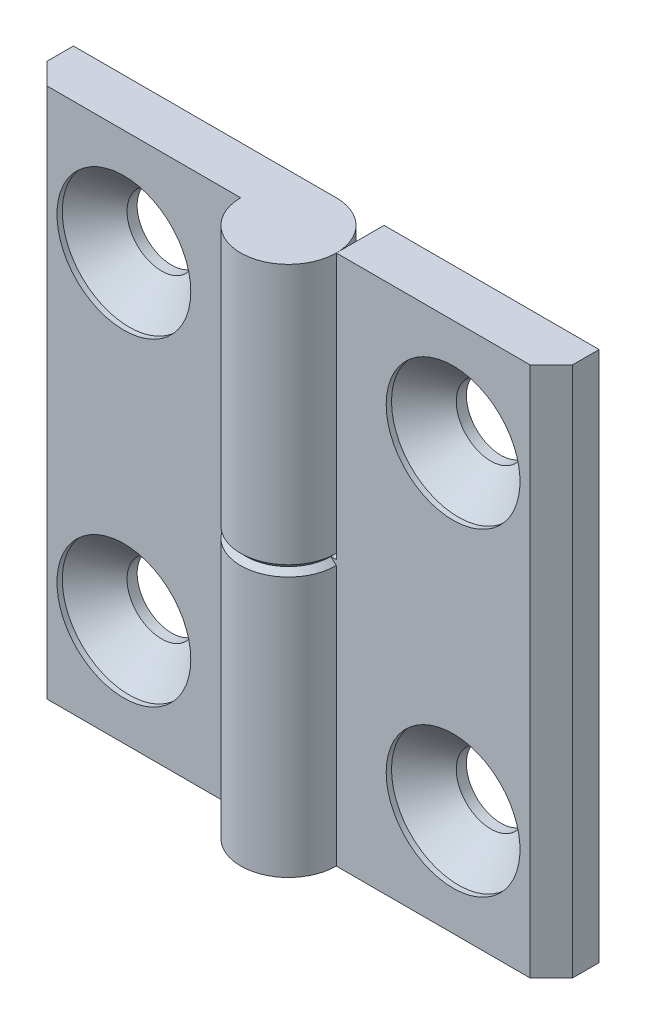
ISO-10303-21;
HEADER;
FILE_DESCRIPTION(('STEP AP214'),'2;1');
FILE_NAME('part.step','',(''),(''),'','','');
FILE_SCHEMA(('AUTOMOTIVE_DESIGN { 1 0 10303 214 1 1 1 1 }'));
ENDSEC;
DATA;
#1=APPLICATION_CONTEXT('core data for automotive mechanical design processes');
#2=APPLICATION_PROTOCOL_DEFINITION('international standard','automotive_design',2000,#1);
#3=PRODUCT_CONTEXT('',#1,'mechanical');
#4=PRODUCT('Part','Part','',(#3));
#5=PRODUCT_RELATED_PRODUCT_CATEGORY('part','',(#4));
#6=PRODUCT_DEFINITION_FORMATION('','',#4);
#7=PRODUCT_DEFINITION_CONTEXT('part definition',#1,'design');
#8=PRODUCT_DEFINITION('design','',#6,#7);
#9=PRODUCT_DEFINITION_SHAPE('','',#8);
#10=(LENGTH_UNIT() NAMED_UNIT(*) SI_UNIT(.MILLI.,.METRE.));
#11=(NAMED_UNIT(*) PLANE_ANGLE_UNIT() SI_UNIT($,.RADIAN.));
#12=(NAMED_UNIT(*) SI_UNIT($,.STERADIAN.) SOLID_ANGLE_UNIT());
#13=UNCERTAINTY_MEASURE_WITH_UNIT(LENGTH_MEASURE(1.E-05),#10,'distance_accuracy_value','');
#14=(GEOMETRIC_REPRESENTATION_CONTEXT(3) GLOBAL_UNCERTAINTY_ASSIGNED_CONTEXT((#13)) GLOBAL_UNIT_ASSIGNED_CONTEXT((#10,
#11,#12)) REPRESENTATION_CONTEXT('',''));
#15=CARTESIAN_POINT('',(0.,0.,0.));
#16=DIRECTION('',(0.,0.,1.));
#17=DIRECTION('',(1.,0.,0.));
#18=AXIS2_PLACEMENT_3D('',#15,#16,#17);
#19=CARTESIAN_POINT('',(0.,-25.,0.));
#20=DIRECTION('',(0.,1.,0.));
#21=DIRECTION('',(0.,0.,-1.));
#22=AXIS2_PLACEMENT_3D('',#19,#20,#21);
#23=CYLINDRICAL_SURFACE('',#22,4.5);
#24=DIRECTION('',(0.,1.,0.));
#25=VECTOR('',#24,1.);
#26=CARTESIAN_POINT('',(4.5,-25.,0.));
#27=LINE('',#26,#25);
#28=CARTESIAN_POINT('',(4.5,-25.,0.));
#29=VERTEX_POINT('',#28);
#30=CARTESIAN_POINT('',(4.5,-0.499999999999987,0.));
#31=VERTEX_POINT('',#30);
#32=EDGE_CURVE('E157',#29,#31,#27,.T.);
#33=ORIENTED_EDGE('',*,*,#32,.T.);
#34=CARTESIAN_POINT('',(0.,-0.499999999999987,0.));
#35=DIRECTION('',(0.,-1.,0.));
#36=DIRECTION('',(0.,0.,1.));
#37=AXIS2_PLACEMENT_3D('',#34,#35,#36);
#38=CIRCLE('',#37,4.5);
#39=CARTESIAN_POINT('',(0.,-0.499999999999987,-4.5));
#40=VERTEX_POINT('',#39);
#41=EDGE_CURVE('E175',#31,#40,#38,.T.);
#42=ORIENTED_EDGE('',*,*,#41,.T.);
#43=DIRECTION('',(0.,1.,0.));
#44=VECTOR('',#43,1.);
#45=CARTESIAN_POINT('',(0.,-25.,-4.5));
#46=LINE('',#45,#44);
#47=CARTESIAN_POINT('',(0.,-25.,-4.5));
#48=VERTEX_POINT('',#47);
#49=EDGE_CURVE('E167',#48,#40,#46,.T.);
#50=ORIENTED_EDGE('',*,*,#49,.F.);
#51=CARTESIAN_POINT('',(0.,-25.,0.));
#52=DIRECTION('',(0.,-1.,0.));
#53=DIRECTION('',(0.,0.,1.));
#54=AXIS2_PLACEMENT_3D('',#51,#52,#53);
#55=CIRCLE('',#54,4.5);
#56=EDGE_CURVE('E156',#29,#48,#55,.T.);
#57=ORIENTED_EDGE('',*,*,#56,.F.);
#58=EDGE_LOOP('',(#33,#42,#50,#57));
#59=FACE_BOUND('',#58,.T.);
#60=ADVANCED_FACE('F46',(#59),#23,.T.);
#61=CARTESIAN_POINT('',(0.,-25.,-4.5));
#62=DIRECTION('',(0.,0.,1.));
#63=DIRECTION('',(-1.,0.,0.));
#64=AXIS2_PLACEMENT_3D('',#61,#62,#63);
#65=PLANE('',#64);
#66=CARTESIAN_POINT('',(15.5,-15.,-4.50000000000012));
#67=DIRECTION('',(0.,0.,1.));
#68=DIRECTION('',(-1.,0.,0.));
#69=AXIS2_PLACEMENT_3D('',#66,#67,#68);
#70=CIRCLE('',#69,3.25);
#71=CARTESIAN_POINT('',(12.25,-15.,-4.50000000000009));
#72=VERTEX_POINT('',#71);
#73=EDGE_CURVE('E197',#72,#72,#70,.T.);
#74=ORIENTED_EDGE('',*,*,#73,.T.);
#75=EDGE_LOOP('',(#74));
#76=FACE_BOUND('',#75,.T.);
#77=CARTESIAN_POINT('',(15.5,15.,-4.50000000000012));
#78=DIRECTION('',(0.,0.,1.));
#79=DIRECTION('',(-1.,0.,0.));
#80=AXIS2_PLACEMENT_3D('',#77,#78,#79);
#81=CIRCLE('',#80,3.25);
#82=CARTESIAN_POINT('',(12.25,15.,-4.50000000000009));
#83=VERTEX_POINT('',#82);
#84=EDGE_CURVE('E139',#83,#83,#81,.T.);
#85=ORIENTED_EDGE('',*,*,#84,.T.);
#86=EDGE_LOOP('',(#85));
#87=FACE_BOUND('',#86,.T.);
#88=ORIENTED_EDGE('',*,*,#49,.T.);
#89=DIRECTION('',(1.,0.,0.));
#90=VECTOR('',#89,1.);
#91=CARTESIAN_POINT('',(0.,-0.499999999999987,-4.5));
#92=LINE('',#91,#90);
#93=CARTESIAN_POINT('',(4.49999999999997,-0.499999999999987,-4.50000000000003));
#94=VERTEX_POINT('',#93);
#95=EDGE_CURVE('E138',#40,#94,#92,.T.);
#96=ORIENTED_EDGE('',*,*,#95,.T.);
#97=DIRECTION('',(0.,1.,0.));
#98=VECTOR('',#97,1.);
#99=CARTESIAN_POINT('',(4.49999999999997,25.,-4.50000000000003));
#100=LINE('',#99,#98);
#101=CARTESIAN_POINT('',(4.49999999999997,25.,-4.50000000000003));
#102=VERTEX_POINT('',#101);
#103=EDGE_CURVE('E119',#94,#102,#100,.T.);
#104=ORIENTED_EDGE('',*,*,#103,.T.);
#105=DIRECTION('',(1.,0.,0.));
#106=VECTOR('',#105,1.);
#107=CARTESIAN_POINT('',(0.,25.,-4.5));
#108=LINE('',#107,#106);
#109=CARTESIAN_POINT('',(24.75,25.,-4.50000000000018));
#110=VERTEX_POINT('',#109);
#111=EDGE_CURVE('E135',#102,#110,#108,.T.);
#112=ORIENTED_EDGE('',*,*,#111,.T.);
#113=DIRECTION('',(0.,1.,0.));
#114=VECTOR('',#113,1.);
#115=CARTESIAN_POINT('',(24.75,-25.,-4.50000000000018));
#116=LINE('',#115,#114);
#117=CARTESIAN_POINT('',(24.75,-25.,-4.50000000000018));
#118=VERTEX_POINT('',#117);
#119=EDGE_CURVE('E165',#118,#110,#116,.T.);
#120=ORIENTED_EDGE('',*,*,#119,.F.);
#121=DIRECTION('',(1.,0.,0.));
#122=VECTOR('',#121,1.);
#123=CARTESIAN_POINT('',(0.,-25.,-4.5));
#124=LINE('',#123,#122);
#125=EDGE_CURVE('E213',#48,#118,#124,.T.);
#126=ORIENTED_EDGE('',*,*,#125,.F.);
#127=EDGE_LOOP('',(#88,#96,#104,#112,#120,#126));
#128=FACE_BOUND('',#127,.T.);
#129=ADVANCED_FACE('F133',(#76,#87,#128),#65,.F.);
#130=CARTESIAN_POINT('',(24.75,-25.,-4.50000000000018));
#131=DIRECTION('',(-1.,0.,0.));
#132=DIRECTION('',(0.,0.,-1.));
#133=AXIS2_PLACEMENT_3D('',#130,#131,#132);
#134=PLANE('',#133);
#135=DIRECTION('',(0.,0.,1.));
#136=VECTOR('',#135,1.);
#137=CARTESIAN_POINT('',(24.75,25.,-4.50000000000018));
#138=LINE('',#137,#136);
#139=CARTESIAN_POINT('',(24.75,25.,-2.00000000000018));
#140=VERTEX_POINT('',#139);
#141=EDGE_CURVE('E144',#110,#140,#138,.T.);
#142=ORIENTED_EDGE('',*,*,#141,.T.);
#143=DIRECTION('',(0.,1.,0.));
#144=VECTOR('',#143,1.);
#145=CARTESIAN_POINT('',(24.75,-25.,-2.00000000000018));
#146=LINE('',#145,#144);
#147=CARTESIAN_POINT('',(24.75,-25.,-2.00000000000018));
#148=VERTEX_POINT('',#147);
#149=EDGE_CURVE('E162',#148,#140,#146,.T.);
#150=ORIENTED_EDGE('',*,*,#149,.F.);
#151=DIRECTION('',(0.,0.,1.));
#152=VECTOR('',#151,1.);
#153=CARTESIAN_POINT('',(24.75,-25.,-4.50000000000018));
#154=LINE('',#153,#152);
#155=EDGE_CURVE('E215',#118,#148,#154,.T.);
#156=ORIENTED_EDGE('',*,*,#155,.F.);
#157=ORIENTED_EDGE('',*,*,#119,.T.);
#158=EDGE_LOOP('',(#142,#150,#156,#157));
#159=FACE_BOUND('',#158,.T.);
#160=ADVANCED_FACE('F229',(#159),#134,.F.);
#161=CARTESIAN_POINT('',(24.75,-25.,-2.00000000000018));
#162=DIRECTION('',(-0.707106781186549,0.,-0.707106781186546));
#163=DIRECTION('',(0.707106781186546,0.,-0.707106781186549));
#164=AXIS2_PLACEMENT_3D('',#161,#162,#163);
#165=PLANE('',#164);
#166=DIRECTION('',(-0.707106781186546,0.,0.707106781186549));
#167=VECTOR('',#166,1.);
#168=CARTESIAN_POINT('',(24.75,25.,-2.00000000000018));
#169=LINE('',#168,#167);
#170=CARTESIAN_POINT('',(22.75,25.,-1.70006686789603E-13));
#171=VERTEX_POINT('',#170);
#172=EDGE_CURVE('E146',#140,#171,#169,.T.);
#173=ORIENTED_EDGE('',*,*,#172,.T.);
#174=DIRECTION('',(0.,1.,0.));
#175=VECTOR('',#174,1.);
#176=CARTESIAN_POINT('',(22.75,-25.,-1.70006686789603E-13));
#177=LINE('',#176,#175);
#178=CARTESIAN_POINT('',(22.75,-25.,-1.70006686789603E-13));
#179=VERTEX_POINT('',#178);
#180=EDGE_CURVE('E159',#179,#171,#177,.T.);
#181=ORIENTED_EDGE('',*,*,#180,.F.);
#182=DIRECTION('',(-0.707106781186546,0.,0.707106781186549));
#183=VECTOR('',#182,1.);
#184=CARTESIAN_POINT('',(24.75,-25.,-2.00000000000018));
#185=LINE('',#184,#183);
#186=EDGE_CURVE('E216',#148,#179,#185,.T.);
#187=ORIENTED_EDGE('',*,*,#186,.F.);
#188=ORIENTED_EDGE('',*,*,#149,.T.);
#189=EDGE_LOOP('',(#173,#181,#187,#188));
#190=FACE_BOUND('',#189,.T.);
#191=ADVANCED_FACE('F231',(#190),#165,.F.);
#192=CARTESIAN_POINT('',(22.75,-25.,-1.70006686789603E-13));
#193=DIRECTION('',(0.,0.,-1.));
#194=DIRECTION('',(1.,0.,0.));
#195=AXIS2_PLACEMENT_3D('',#192,#193,#194);
#196=PLANE('',#195);
#197=CARTESIAN_POINT('',(15.5,-15.,-1.16045572093348E-13));
#198=DIRECTION('',(0.,0.,1.));
#199=DIRECTION('',(-1.,0.,0.));
#200=AXIS2_PLACEMENT_3D('',#197,#198,#199);
#201=CIRCLE('',#200,6.3);
#202=CARTESIAN_POINT('',(9.2,-15.,0.));
#203=VERTEX_POINT('',#202);
#204=EDGE_CURVE('E185',#203,#203,#201,.T.);
#205=ORIENTED_EDGE('',*,*,#204,.F.);
#206=EDGE_LOOP('',(#205));
#207=FACE_BOUND('',#206,.T.);
#208=CARTESIAN_POINT('',(15.5,15.,-1.16045572093348E-13));
#209=DIRECTION('',(0.,0.,1.));
#210=DIRECTION('',(-1.,0.,0.));
#211=AXIS2_PLACEMENT_3D('',#208,#209,#210);
#212=CIRCLE('',#211,6.3);
#213=CARTESIAN_POINT('',(9.2,15.,0.));
#214=VERTEX_POINT('',#213);
#215=EDGE_CURVE('E200',#214,#214,#212,.T.);
#216=ORIENTED_EDGE('',*,*,#215,.F.);
#217=EDGE_LOOP('',(#216));
#218=FACE_BOUND('',#217,.T.);
#219=DIRECTION('',(-1.,0.,0.));
#220=VECTOR('',#219,1.);
#221=CARTESIAN_POINT('',(22.75,25.,-1.70006686789603E-13));
#222=LINE('',#221,#220);
#223=CARTESIAN_POINT('',(4.5,25.,0.));
#224=VERTEX_POINT('',#223);
#225=EDGE_CURVE('E154',#171,#224,#222,.T.);
#226=ORIENTED_EDGE('',*,*,#225,.T.);
#227=DIRECTION('',(0.,-1.,0.));
#228=VECTOR('',#227,1.);
#229=CARTESIAN_POINT('',(4.5,-25.,0.));
#230=LINE('',#229,#228);
#231=CARTESIAN_POINT('',(4.5,0.,0.));
#232=VERTEX_POINT('',#231);
#233=EDGE_CURVE('E123',#224,#232,#230,.T.);
#234=ORIENTED_EDGE('',*,*,#233,.T.);
#235=DIRECTION('',(1.,0.,0.));
#236=VECTOR('',#235,1.);
#237=CARTESIAN_POINT('',(-4.5,0.,0.));
#238=LINE('',#237,#236);
#239=CARTESIAN_POINT('',(4.00000000000001,0.,0.));
#240=VERTEX_POINT('',#239);
#241=EDGE_CURVE('E170',#240,#232,#238,.T.);
#242=ORIENTED_EDGE('',*,*,#241,.F.);
#243=DIRECTION('',(0.707106781186553,-0.707106781186542,0.));
#244=VECTOR('',#243,1.);
#245=CARTESIAN_POINT('',(0.,3.99999999999994,0.));
#246=LINE('',#245,#244);
#247=EDGE_CURVE('E12',#240,#31,#246,.T.);
#248=ORIENTED_EDGE('',*,*,#247,.T.);
#249=ORIENTED_EDGE('',*,*,#32,.F.);
#250=DIRECTION('',(-1.,0.,0.));
#251=VECTOR('',#250,1.);
#252=CARTESIAN_POINT('',(22.75,-25.,-1.70006686789603E-13));
#253=LINE('',#252,#251);
#254=EDGE_CURVE('E150',#179,#29,#253,.T.);
#255=ORIENTED_EDGE('',*,*,#254,.F.);
#256=ORIENTED_EDGE('',*,*,#180,.T.);
#257=EDGE_LOOP('',(#226,#234,#242,#248,#249,#255,#256));
#258=FACE_BOUND('',#257,.T.);
#259=ADVANCED_FACE('F224',(#207,#218,#258),#196,.F.);
#260=CARTESIAN_POINT('',(0.,-25.,0.));
#261=DIRECTION('',(0.,-1.,0.));
#262=DIRECTION('',(0.,0.,1.));
#263=AXIS2_PLACEMENT_3D('',#260,#261,#262);
#264=PLANE('',#263);
#265=ORIENTED_EDGE('',*,*,#56,.T.);
#266=ORIENTED_EDGE('',*,*,#125,.T.);
#267=ORIENTED_EDGE('',*,*,#155,.T.);
#268=ORIENTED_EDGE('',*,*,#186,.T.);
#269=ORIENTED_EDGE('',*,*,#254,.T.);
#270=EDGE_LOOP('',(#265,#266,#267,#268,#269));
#271=FACE_BOUND('',#270,.T.);
#272=ADVANCED_FACE('F221',(#271),#264,.T.);
#273=CARTESIAN_POINT('',(0.,25.,0.));
#274=DIRECTION('',(0.,-1.,0.));
#275=DIRECTION('',(0.,0.,1.));
#276=AXIS2_PLACEMENT_3D('',#273,#274,#275);
#277=PLANE('',#276);
#278=ORIENTED_EDGE('',*,*,#111,.F.);
#279=DIRECTION('',(0.,0.,1.));
#280=VECTOR('',#279,1.);
#281=CARTESIAN_POINT('',(4.49999999999997,25.,-4.50000000000003));
#282=LINE('',#281,#280);
#283=EDGE_CURVE('E116',#102,#224,#282,.T.);
#284=ORIENTED_EDGE('',*,*,#283,.T.);
#285=ORIENTED_EDGE('',*,*,#225,.F.);
#286=ORIENTED_EDGE('',*,*,#172,.F.);
#287=ORIENTED_EDGE('',*,*,#141,.F.);
#288=EDGE_LOOP('',(#278,#284,#285,#286,#287));
#289=FACE_BOUND('',#288,.T.);
#290=ADVANCED_FACE('F142',(#289),#277,.F.);
#291=CARTESIAN_POINT('',(-4.50000000000003,0.,-4.49999999999997));
#292=DIRECTION('',(0.,-1.,0.));
#293=DIRECTION('',(0.,0.,1.));
#294=AXIS2_PLACEMENT_3D('',#291,#292,#293);
#295=PLANE('',#294);
#296=DIRECTION('',(0.,0.,1.));
#297=VECTOR('',#296,1.);
#298=CARTESIAN_POINT('',(4.49999999999997,0.,-4.50000000000003));
#299=LINE('',#298,#297);
#300=CARTESIAN_POINT('',(4.49999999999997,0.,-4.00000000000004));
#301=VERTEX_POINT('',#300);
#302=EDGE_CURVE('E128',#301,#232,#299,.T.);
#303=ORIENTED_EDGE('',*,*,#302,.F.);
#304=DIRECTION('',(-1.,0.,0.));
#305=VECTOR('',#304,1.);
#306=CARTESIAN_POINT('',(-4.50000000000003,0.,-3.99999999999997));
#307=LINE('',#306,#305);
#308=CARTESIAN_POINT('',(0.,0.,-4.00000000000001));
#309=VERTEX_POINT('',#308);
#310=EDGE_CURVE('E69',#301,#309,#307,.T.);
#311=ORIENTED_EDGE('',*,*,#310,.T.);
#312=CARTESIAN_POINT('',(0.,0.,0.));
#313=DIRECTION('',(0.,-1.,0.));
#314=DIRECTION('',(0.,0.,1.));
#315=AXIS2_PLACEMENT_3D('',#312,#313,#314);
#316=CIRCLE('',#315,4.00000000000001);
#317=EDGE_CURVE('E172',#309,#240,#316,.F.);
#318=ORIENTED_EDGE('',*,*,#317,.T.);
#319=ORIENTED_EDGE('',*,*,#241,.T.);
#320=EDGE_LOOP('',(#303,#311,#318,#319));
#321=FACE_BOUND('',#320,.T.);
#322=ADVANCED_FACE('F178',(#321),#295,.F.);
#323=CARTESIAN_POINT('',(4.49999999999997,25.,-4.50000000000003));
#324=DIRECTION('',(1.,0.,0.));
#325=DIRECTION('',(0.,0.,1.));
#326=AXIS2_PLACEMENT_3D('',#323,#324,#325);
#327=PLANE('',#326);
#328=ORIENTED_EDGE('',*,*,#283,.F.);
#329=ORIENTED_EDGE('',*,*,#103,.F.);
#330=DIRECTION('',(0.,-0.707106781186542,-0.707106781186553));
#331=VECTOR('',#330,1.);
#332=CARTESIAN_POINT('',(4.50000000000006,12.2499999999998,8.24999999999996));
#333=LINE('',#332,#331);
#334=EDGE_CURVE('E56',#94,#301,#333,.F.);
#335=ORIENTED_EDGE('',*,*,#334,.T.);
#336=ORIENTED_EDGE('',*,*,#302,.T.);
#337=ORIENTED_EDGE('',*,*,#233,.F.);
#338=EDGE_LOOP('',(#328,#329,#335,#336,#337));
#339=FACE_BOUND('',#338,.T.);
#340=ADVANCED_FACE('F118',(#339),#327,.F.);
#341=CARTESIAN_POINT('',(15.5,15.,-1.15828731658851E-13));
#342=DIRECTION('',(0.,0.,1.));
#343=DIRECTION('',(-1.,0.,0.));
#344=AXIS2_PLACEMENT_3D('',#341,#342,#343);
#345=CYLINDRICAL_SURFACE('',#344,3.25);
#346=ORIENTED_EDGE('',*,*,#84,.F.);
#347=EDGE_LOOP('',(#346));
#348=FACE_BOUND('',#347,.T.);
#349=CARTESIAN_POINT('',(15.5,15.,-3.55000000000011));
#350=DIRECTION('',(0.,0.,1.));
#351=DIRECTION('',(-1.,0.,0.));
#352=AXIS2_PLACEMENT_3D('',#349,#350,#351);
#353=CIRCLE('',#352,3.25);
#354=CARTESIAN_POINT('',(12.25,15.,-3.55000000000009));
#355=VERTEX_POINT('',#354);
#356=EDGE_CURVE('E206',#355,#355,#353,.T.);
#357=ORIENTED_EDGE('',*,*,#356,.T.);
#358=EDGE_LOOP('',(#357));
#359=FACE_BOUND('',#358,.T.);
#360=ADVANCED_FACE('F269',(#348,#359),#345,.F.);
#361=CARTESIAN_POINT('',(15.5,15.,-0.500000000000116));
#362=DIRECTION('',(0.,0.,1.));
#363=DIRECTION('',(-1.,0.,0.));
#364=AXIS2_PLACEMENT_3D('',#361,#362,#363);
#365=CONICAL_SURFACE('',#364,6.3,0.785398163397449);
#366=ORIENTED_EDGE('',*,*,#356,.F.);
#367=EDGE_LOOP('',(#366));
#368=FACE_BOUND('',#367,.T.);
#369=CARTESIAN_POINT('',(15.5,15.,-0.500000000000116));
#370=DIRECTION('',(0.,0.,1.));
#371=DIRECTION('',(-1.,0.,0.));
#372=AXIS2_PLACEMENT_3D('',#369,#370,#371);
#373=CIRCLE('',#372,6.3);
#374=CARTESIAN_POINT('',(9.19999999999999,15.,-0.500000000000069));
#375=VERTEX_POINT('',#374);
#376=EDGE_CURVE('E203',#375,#375,#373,.T.);
#377=ORIENTED_EDGE('',*,*,#376,.T.);
#378=EDGE_LOOP('',(#377));
#379=FACE_BOUND('',#378,.T.);
#380=ADVANCED_FACE('F272',(#368,#379),#365,.F.);
#381=CARTESIAN_POINT('',(15.5,15.,-1.15828731658851E-13));
#382=DIRECTION('',(0.,0.,1.));
#383=DIRECTION('',(-1.,0.,0.));
#384=AXIS2_PLACEMENT_3D('',#381,#382,#383);
#385=CYLINDRICAL_SURFACE('',#384,6.3);
#386=ORIENTED_EDGE('',*,*,#376,.F.);
#387=EDGE_LOOP('',(#386));
#388=FACE_BOUND('',#387,.T.);
#389=ORIENTED_EDGE('',*,*,#215,.T.);
#390=EDGE_LOOP('',(#389));
#391=FACE_BOUND('',#390,.T.);
#392=ADVANCED_FACE('F276',(#388,#391),#385,.F.);
#393=CARTESIAN_POINT('',(15.5,-15.,-1.15828731658851E-13));
#394=DIRECTION('',(0.,0.,1.));
#395=DIRECTION('',(-1.,0.,0.));
#396=AXIS2_PLACEMENT_3D('',#393,#394,#395);
#397=CYLINDRICAL_SURFACE('',#396,3.25);
#398=ORIENTED_EDGE('',*,*,#73,.F.);
#399=EDGE_LOOP('',(#398));
#400=FACE_BOUND('',#399,.T.);
#401=CARTESIAN_POINT('',(15.5,-15.,-3.55000000000011));
#402=DIRECTION('',(0.,0.,1.));
#403=DIRECTION('',(-1.,0.,0.));
#404=AXIS2_PLACEMENT_3D('',#401,#402,#403);
#405=CIRCLE('',#404,3.25);
#406=CARTESIAN_POINT('',(12.25,-15.,-3.55000000000009));
#407=VERTEX_POINT('',#406);
#408=EDGE_CURVE('E192',#407,#407,#405,.T.);
#409=ORIENTED_EDGE('',*,*,#408,.T.);
#410=EDGE_LOOP('',(#409));
#411=FACE_BOUND('',#410,.T.);
#412=ADVANCED_FACE('F280',(#400,#411),#397,.F.);
#413=CARTESIAN_POINT('',(15.5,-15.,-0.500000000000116));
#414=DIRECTION('',(0.,0.,1.));
#415=DIRECTION('',(-1.,0.,0.));
#416=AXIS2_PLACEMENT_3D('',#413,#414,#415);
#417=CONICAL_SURFACE('',#416,6.3,0.785398163397449);
#418=ORIENTED_EDGE('',*,*,#408,.F.);
#419=EDGE_LOOP('',(#418));
#420=FACE_BOUND('',#419,.T.);
#421=CARTESIAN_POINT('',(15.5,-15.,-0.500000000000116));
#422=DIRECTION('',(0.,0.,1.));
#423=DIRECTION('',(-1.,0.,0.));
#424=AXIS2_PLACEMENT_3D('',#421,#422,#423);
#425=CIRCLE('',#424,6.3);
#426=CARTESIAN_POINT('',(9.19999999999999,-15.,-0.500000000000069));
#427=VERTEX_POINT('',#426);
#428=EDGE_CURVE('E187',#427,#427,#425,.T.);
#429=ORIENTED_EDGE('',*,*,#428,.T.);
#430=EDGE_LOOP('',(#429));
#431=FACE_BOUND('',#430,.T.);
#432=ADVANCED_FACE('F238',(#420,#431),#417,.F.);
#433=CARTESIAN_POINT('',(15.5,-15.,-1.15828731658851E-13));
#434=DIRECTION('',(0.,0.,1.));
#435=DIRECTION('',(-1.,0.,0.));
#436=AXIS2_PLACEMENT_3D('',#433,#434,#435);
#437=CYLINDRICAL_SURFACE('',#436,6.3);
#438=ORIENTED_EDGE('',*,*,#428,.F.);
#439=EDGE_LOOP('',(#438));
#440=FACE_BOUND('',#439,.T.);
#441=ORIENTED_EDGE('',*,*,#204,.T.);
#442=EDGE_LOOP('',(#441));
#443=FACE_BOUND('',#442,.T.);
#444=ADVANCED_FACE('F233',(#440,#443),#437,.F.);
#445=CARTESIAN_POINT('',(0.,-0.499999999999987,0.));
#446=DIRECTION('',(0.,-1.,0.));
#447=DIRECTION('',(0.,0.,1.));
#448=AXIS2_PLACEMENT_3D('',#445,#446,#447);
#449=CONICAL_SURFACE('',#448,4.5,0.785398163397456);
#450=ORIENTED_EDGE('',*,*,#247,.F.);
#451=ORIENTED_EDGE('',*,*,#317,.F.);
#452=DIRECTION('',(0.,0.707106781186542,0.707106781186553));
#453=VECTOR('',#452,1.);
#454=CARTESIAN_POINT('',(0.,-0.499999999999987,-4.5));
#455=LINE('',#454,#453);
#456=EDGE_CURVE('E51',#40,#309,#455,.T.);
#457=ORIENTED_EDGE('',*,*,#456,.F.);
#458=ORIENTED_EDGE('',*,*,#41,.F.);
#459=EDGE_LOOP('',(#450,#451,#457,#458));
#460=FACE_BOUND('',#459,.T.);
#461=ADVANCED_FACE('F49',(#460),#449,.T.);
#462=CARTESIAN_POINT('',(0.,-0.499999999999987,-4.5));
#463=DIRECTION('',(0.,-0.707106781186553,0.707106781186542));
#464=DIRECTION('',(1.,0.,0.));
#465=AXIS2_PLACEMENT_3D('',#462,#463,#464);
#466=PLANE('',#465);
#467=ORIENTED_EDGE('',*,*,#456,.T.);
#468=ORIENTED_EDGE('',*,*,#310,.F.);
#469=ORIENTED_EDGE('',*,*,#334,.F.);
#470=ORIENTED_EDGE('',*,*,#95,.F.);
#471=EDGE_LOOP('',(#467,#468,#469,#470));
#472=FACE_BOUND('',#471,.T.);
#473=ADVANCED_FACE('F181',(#472),#466,.F.);
#474=CLOSED_SHELL('',(#60,#129,#160,#191,#259,#272,#290,#322,#340,#360,#380,#392,#412,#432,#444,
#461,#473));
#475=MANIFOLD_SOLID_BREP('B2',#474);
#476=CARTESIAN_POINT('',(0.,25.,0.));
#477=DIRECTION('',(0.,-1.,0.));
#478=DIRECTION('',(0.,0.,-1.));
#479=AXIS2_PLACEMENT_3D('',#476,#477,#478);
#480=CYLINDRICAL_SURFACE('',#479,4.5);
#481=DIRECTION('',(0.,-1.,0.));
#482=VECTOR('',#481,1.);
#483=CARTESIAN_POINT('',(-4.5,25.,0.));
#484=LINE('',#483,#482);
#485=CARTESIAN_POINT('',(-4.5,25.,0.));
#486=VERTEX_POINT('',#485);
#487=CARTESIAN_POINT('',(-4.5,0.499999999999987,0.));
#488=VERTEX_POINT('',#487);
#489=EDGE_CURVE('E512',#486,#488,#484,.T.);
#490=ORIENTED_EDGE('',*,*,#489,.T.);
#491=CARTESIAN_POINT('',(0.,0.499999999999987,0.));
#492=DIRECTION('',(0.,1.,0.));
#493=DIRECTION('',(0.,0.,1.));
#494=AXIS2_PLACEMENT_3D('',#491,#492,#493);
#495=CIRCLE('',#494,4.5);
#496=CARTESIAN_POINT('',(0.,0.499999999999987,-4.5));
#497=VERTEX_POINT('',#496);
#498=EDGE_CURVE('E530',#488,#497,#495,.T.);
#499=ORIENTED_EDGE('',*,*,#498,.T.);
#500=DIRECTION('',(0.,-1.,0.));
#501=VECTOR('',#500,1.);
#502=CARTESIAN_POINT('',(0.,25.,-4.5));
#503=LINE('',#502,#501);
#504=CARTESIAN_POINT('',(0.,25.,-4.5));
#505=VERTEX_POINT('',#504);
#506=EDGE_CURVE('E522',#505,#497,#503,.T.);
#507=ORIENTED_EDGE('',*,*,#506,.F.);
#508=CARTESIAN_POINT('',(0.,25.,0.));
#509=DIRECTION('',(0.,1.,0.));
#510=DIRECTION('',(0.,0.,1.));
#511=AXIS2_PLACEMENT_3D('',#508,#509,#510);
#512=CIRCLE('',#511,4.5);
#513=EDGE_CURVE('E511',#486,#505,#512,.T.);
#514=ORIENTED_EDGE('',*,*,#513,.F.);
#515=EDGE_LOOP('',(#490,#499,#507,#514));
#516=FACE_BOUND('',#515,.T.);
#517=ADVANCED_FACE('F401',(#516),#480,.T.);
#518=CARTESIAN_POINT('',(0.,25.,-4.5));
#519=DIRECTION('',(0.,0.,1.));
#520=DIRECTION('',(1.,0.,0.));
#521=AXIS2_PLACEMENT_3D('',#518,#519,#520);
#522=PLANE('',#521);
#523=CARTESIAN_POINT('',(-15.5,15.,-4.5));
#524=DIRECTION('',(0.,0.,1.));
#525=DIRECTION('',(1.,0.,0.));
#526=AXIS2_PLACEMENT_3D('',#523,#524,#525);
#527=CIRCLE('',#526,3.25);
#528=CARTESIAN_POINT('',(-12.25,15.,-4.5));
#529=VERTEX_POINT('',#528);
#530=EDGE_CURVE('E552',#529,#529,#527,.T.);
#531=ORIENTED_EDGE('',*,*,#530,.T.);
#532=EDGE_LOOP('',(#531));
#533=FACE_BOUND('',#532,.T.);
#534=CARTESIAN_POINT('',(-15.5,-15.,-4.5));
#535=DIRECTION('',(0.,0.,1.));
#536=DIRECTION('',(1.,0.,0.));
#537=AXIS2_PLACEMENT_3D('',#534,#535,#536);
#538=CIRCLE('',#537,3.25);
#539=CARTESIAN_POINT('',(-12.25,-15.,-4.5));
#540=VERTEX_POINT('',#539);
#541=EDGE_CURVE('E494',#540,#540,#538,.T.);
#542=ORIENTED_EDGE('',*,*,#541,.T.);
#543=EDGE_LOOP('',(#542));
#544=FACE_BOUND('',#543,.T.);
#545=ORIENTED_EDGE('',*,*,#506,.T.);
#546=DIRECTION('',(-1.,0.,0.));
#547=VECTOR('',#546,1.);
#548=CARTESIAN_POINT('',(0.,0.499999999999987,-4.5));
#549=LINE('',#548,#547);
#550=CARTESIAN_POINT('',(-4.5,0.499999999999987,-4.5));
#551=VERTEX_POINT('',#550);
#552=EDGE_CURVE('E493',#497,#551,#549,.T.);
#553=ORIENTED_EDGE('',*,*,#552,.T.);
#554=DIRECTION('',(0.,-1.,0.));
#555=VECTOR('',#554,1.);
#556=CARTESIAN_POINT('',(-4.5,-25.,-4.5));
#557=LINE('',#556,#555);
#558=CARTESIAN_POINT('',(-4.5,-25.,-4.5));
#559=VERTEX_POINT('',#558);
#560=EDGE_CURVE('E474',#551,#559,#557,.T.);
#561=ORIENTED_EDGE('',*,*,#560,.T.);
#562=DIRECTION('',(-1.,0.,0.));
#563=VECTOR('',#562,1.);
#564=CARTESIAN_POINT('',(0.,-25.,-4.5));
#565=LINE('',#564,#563);
#566=CARTESIAN_POINT('',(-24.75,-25.,-4.5));
#567=VERTEX_POINT('',#566);
#568=EDGE_CURVE('E490',#559,#567,#565,.T.);
#569=ORIENTED_EDGE('',*,*,#568,.T.);
#570=DIRECTION('',(0.,-1.,0.));
#571=VECTOR('',#570,1.);
#572=CARTESIAN_POINT('',(-24.75,25.,-4.5));
#573=LINE('',#572,#571);
#574=CARTESIAN_POINT('',(-24.75,25.,-4.5));
#575=VERTEX_POINT('',#574);
#576=EDGE_CURVE('E520',#575,#567,#573,.T.);
#577=ORIENTED_EDGE('',*,*,#576,.F.);
#578=DIRECTION('',(-1.,0.,0.));
#579=VECTOR('',#578,1.);
#580=CARTESIAN_POINT('',(0.,25.,-4.5));
#581=LINE('',#580,#579);
#582=EDGE_CURVE('E568',#505,#575,#581,.T.);
#583=ORIENTED_EDGE('',*,*,#582,.F.);
#584=EDGE_LOOP('',(#545,#553,#561,#569,#577,#583));
#585=FACE_BOUND('',#584,.T.);
#586=ADVANCED_FACE('F488',(#533,#544,#585),#522,.F.);
#587=CARTESIAN_POINT('',(-24.75,25.,-4.5));
#588=DIRECTION('',(1.,0.,0.));
#589=DIRECTION('',(0.,0.,-1.));
#590=AXIS2_PLACEMENT_3D('',#587,#588,#589);
#591=PLANE('',#590);
#592=DIRECTION('',(0.,0.,1.));
#593=VECTOR('',#592,1.);
#594=CARTESIAN_POINT('',(-24.75,-25.,-4.5));
#595=LINE('',#594,#593);
#596=CARTESIAN_POINT('',(-24.75,-25.,-2.));
#597=VERTEX_POINT('',#596);
#598=EDGE_CURVE('E499',#567,#597,#595,.T.);
#599=ORIENTED_EDGE('',*,*,#598,.T.);
#600=DIRECTION('',(0.,-1.,0.));
#601=VECTOR('',#600,1.);
#602=CARTESIAN_POINT('',(-24.75,25.,-2.));
#603=LINE('',#602,#601);
#604=CARTESIAN_POINT('',(-24.75,25.,-2.));
#605=VERTEX_POINT('',#604);
#606=EDGE_CURVE('E517',#605,#597,#603,.T.);
#607=ORIENTED_EDGE('',*,*,#606,.F.);
#608=DIRECTION('',(0.,0.,1.));
#609=VECTOR('',#608,1.);
#610=CARTESIAN_POINT('',(-24.75,25.,-4.5));
#611=LINE('',#610,#609);
#612=EDGE_CURVE('E570',#575,#605,#611,.T.);
#613=ORIENTED_EDGE('',*,*,#612,.F.);
#614=ORIENTED_EDGE('',*,*,#576,.T.);
#615=EDGE_LOOP('',(#599,#607,#613,#614));
#616=FACE_BOUND('',#615,.T.);
#617=ADVANCED_FACE('F584',(#616),#591,.F.);
#618=CARTESIAN_POINT('',(-24.75,25.,-2.));
#619=DIRECTION('',(0.707106781186544,0.,-0.707106781186551));
#620=DIRECTION('',(-0.707106781186551,0.,-0.707106781186544));
#621=AXIS2_PLACEMENT_3D('',#618,#619,#620);
#622=PLANE('',#621);
#623=DIRECTION('',(0.707106781186551,0.,0.707106781186544));
#624=VECTOR('',#623,1.);
#625=CARTESIAN_POINT('',(-24.75,-25.,-2.));
#626=LINE('',#625,#624);
#627=CARTESIAN_POINT('',(-22.75,-25.,0.));
#628=VERTEX_POINT('',#627);
#629=EDGE_CURVE('E501',#597,#628,#626,.T.);
#630=ORIENTED_EDGE('',*,*,#629,.T.);
#631=DIRECTION('',(0.,-1.,0.));
#632=VECTOR('',#631,1.);
#633=CARTESIAN_POINT('',(-22.75,25.,0.));
#634=LINE('',#633,#632);
#635=CARTESIAN_POINT('',(-22.75,25.,0.));
#636=VERTEX_POINT('',#635);
#637=EDGE_CURVE('E514',#636,#628,#634,.T.);
#638=ORIENTED_EDGE('',*,*,#637,.F.);
#639=DIRECTION('',(0.707106781186551,0.,0.707106781186544));
#640=VECTOR('',#639,1.);
#641=CARTESIAN_POINT('',(-24.75,25.,-2.));
#642=LINE('',#641,#640);
#643=EDGE_CURVE('E571',#605,#636,#642,.T.);
#644=ORIENTED_EDGE('',*,*,#643,.F.);
#645=ORIENTED_EDGE('',*,*,#606,.T.);
#646=EDGE_LOOP('',(#630,#638,#644,#645));
#647=FACE_BOUND('',#646,.T.);
#648=ADVANCED_FACE('F586',(#647),#622,.F.);
#649=CARTESIAN_POINT('',(-22.75,25.,0.));
#650=DIRECTION('',(0.,0.,-1.));
#651=DIRECTION('',(-1.,0.,0.));
#652=AXIS2_PLACEMENT_3D('',#649,#650,#651);
#653=PLANE('',#652);
#654=CARTESIAN_POINT('',(-15.5,15.,0.));
#655=DIRECTION('',(0.,0.,1.));
#656=DIRECTION('',(1.,0.,0.));
#657=AXIS2_PLACEMENT_3D('',#654,#655,#656);
#658=CIRCLE('',#657,6.3);
#659=CARTESIAN_POINT('',(-9.2,15.,0.));
#660=VERTEX_POINT('',#659);
#661=EDGE_CURVE('E540',#660,#660,#658,.T.);
#662=ORIENTED_EDGE('',*,*,#661,.F.);
#663=EDGE_LOOP('',(#662));
#664=FACE_BOUND('',#663,.T.);
#665=CARTESIAN_POINT('',(-15.5,-15.,0.));
#666=DIRECTION('',(0.,0.,1.));
#667=DIRECTION('',(1.,0.,0.));
#668=AXIS2_PLACEMENT_3D('',#665,#666,#667);
#669=CIRCLE('',#668,6.3);
#670=CARTESIAN_POINT('',(-9.2,-15.,0.));
#671=VERTEX_POINT('',#670);
#672=EDGE_CURVE('E555',#671,#671,#669,.T.);
#673=ORIENTED_EDGE('',*,*,#672,.F.);
#674=EDGE_LOOP('',(#673));
#675=FACE_BOUND('',#674,.T.);
#676=DIRECTION('',(1.,0.,0.));
#677=VECTOR('',#676,1.);
#678=CARTESIAN_POINT('',(-22.75,-25.,0.));
#679=LINE('',#678,#677);
#680=CARTESIAN_POINT('',(-4.5,-25.,0.));
#681=VERTEX_POINT('',#680);
#682=EDGE_CURVE('E509',#628,#681,#679,.T.);
#683=ORIENTED_EDGE('',*,*,#682,.T.);
#684=DIRECTION('',(0.,1.,0.));
#685=VECTOR('',#684,1.);
#686=CARTESIAN_POINT('',(-4.5,25.,0.));
#687=LINE('',#686,#685);
#688=CARTESIAN_POINT('',(-4.5,0.,0.));
#689=VERTEX_POINT('',#688);
#690=EDGE_CURVE('E478',#681,#689,#687,.T.);
#691=ORIENTED_EDGE('',*,*,#690,.T.);
#692=DIRECTION('',(-1.,0.,0.));
#693=VECTOR('',#692,1.);
#694=CARTESIAN_POINT('',(4.5,0.,0.));
#695=LINE('',#694,#693);
#696=CARTESIAN_POINT('',(-4.00000000000001,0.,0.));
#697=VERTEX_POINT('',#696);
#698=EDGE_CURVE('E525',#697,#689,#695,.T.);
#699=ORIENTED_EDGE('',*,*,#698,.F.);
#700=DIRECTION('',(-0.707106781186553,0.707106781186542,0.));
#701=VECTOR('',#700,1.);
#702=CARTESIAN_POINT('',(0.,-3.99999999999994,0.));
#703=LINE('',#702,#701);
#704=EDGE_CURVE('E44',#697,#488,#703,.T.);
#705=ORIENTED_EDGE('',*,*,#704,.T.);
#706=ORIENTED_EDGE('',*,*,#489,.F.);
#707=DIRECTION('',(1.,0.,0.));
#708=VECTOR('',#707,1.);
#709=CARTESIAN_POINT('',(-22.75,25.,0.));
#710=LINE('',#709,#708);
#711=EDGE_CURVE('E505',#636,#486,#710,.T.);
#712=ORIENTED_EDGE('',*,*,#711,.F.);
#713=ORIENTED_EDGE('',*,*,#637,.T.);
#714=EDGE_LOOP('',(#683,#691,#699,#705,#706,#712,#713));
#715=FACE_BOUND('',#714,.T.);
#716=ADVANCED_FACE('F579',(#664,#675,#715),#653,.F.);
#717=CARTESIAN_POINT('',(0.,25.,0.));
#718=DIRECTION('',(0.,1.,0.));
#719=DIRECTION('',(0.,0.,1.));
#720=AXIS2_PLACEMENT_3D('',#717,#718,#719);
#721=PLANE('',#720);
#722=ORIENTED_EDGE('',*,*,#513,.T.);
#723=ORIENTED_EDGE('',*,*,#582,.T.);
#724=ORIENTED_EDGE('',*,*,#612,.T.);
#725=ORIENTED_EDGE('',*,*,#643,.T.);
#726=ORIENTED_EDGE('',*,*,#711,.T.);
#727=EDGE_LOOP('',(#722,#723,#724,#725,#726));
#728=FACE_BOUND('',#727,.T.);
#729=ADVANCED_FACE('F576',(#728),#721,.T.);
#730=CARTESIAN_POINT('',(0.,-25.,0.));
#731=DIRECTION('',(0.,1.,0.));
#732=DIRECTION('',(0.,0.,1.));
#733=AXIS2_PLACEMENT_3D('',#730,#731,#732);
#734=PLANE('',#733);
#735=ORIENTED_EDGE('',*,*,#568,.F.);
#736=DIRECTION('',(0.,0.,1.));
#737=VECTOR('',#736,1.);
#738=CARTESIAN_POINT('',(-4.5,-25.,-4.5));
#739=LINE('',#738,#737);
#740=EDGE_CURVE('E471',#559,#681,#739,.T.);
#741=ORIENTED_EDGE('',*,*,#740,.T.);
#742=ORIENTED_EDGE('',*,*,#682,.F.);
#743=ORIENTED_EDGE('',*,*,#629,.F.);
#744=ORIENTED_EDGE('',*,*,#598,.F.);
#745=EDGE_LOOP('',(#735,#741,#742,#743,#744));
#746=FACE_BOUND('',#745,.T.);
#747=ADVANCED_FACE('F497',(#746),#734,.F.);
#748=CARTESIAN_POINT('',(4.5,0.,-4.5));
#749=DIRECTION('',(0.,1.,0.));
#750=DIRECTION('',(0.,0.,1.));
#751=AXIS2_PLACEMENT_3D('',#748,#749,#750);
#752=PLANE('',#751);
#753=DIRECTION('',(0.,0.,1.));
#754=VECTOR('',#753,1.);
#755=CARTESIAN_POINT('',(-4.5,0.,-4.5));
#756=LINE('',#755,#754);
#757=CARTESIAN_POINT('',(-4.5,0.,-4.));
#758=VERTEX_POINT('',#757);
#759=EDGE_CURVE('E483',#758,#689,#756,.T.);
#760=ORIENTED_EDGE('',*,*,#759,.F.);
#761=DIRECTION('',(1.,0.,0.));
#762=VECTOR('',#761,1.);
#763=CARTESIAN_POINT('',(4.5,0.,-4.00000000000001));
#764=LINE('',#763,#762);
#765=CARTESIAN_POINT('',(0.,0.,-4.00000000000001));
#766=VERTEX_POINT('',#765);
#767=EDGE_CURVE('E424',#758,#766,#764,.T.);
#768=ORIENTED_EDGE('',*,*,#767,.T.);
#769=CARTESIAN_POINT('',(0.,0.,0.));
#770=DIRECTION('',(0.,1.,0.));
#771=DIRECTION('',(0.,0.,1.));
#772=AXIS2_PLACEMENT_3D('',#769,#770,#771);
#773=CIRCLE('',#772,4.00000000000001);
#774=EDGE_CURVE('E527',#766,#697,#773,.F.);
#775=ORIENTED_EDGE('',*,*,#774,.T.);
#776=ORIENTED_EDGE('',*,*,#698,.T.);
#777=EDGE_LOOP('',(#760,#768,#775,#776));
#778=FACE_BOUND('',#777,.T.);
#779=ADVANCED_FACE('F533',(#778),#752,.F.);
#780=CARTESIAN_POINT('',(-4.5,-25.,-4.5));
#781=DIRECTION('',(-1.,0.,0.));
#782=DIRECTION('',(0.,0.,1.));
#783=AXIS2_PLACEMENT_3D('',#780,#781,#782);
#784=PLANE('',#783);
#785=ORIENTED_EDGE('',*,*,#740,.F.);
#786=ORIENTED_EDGE('',*,*,#560,.F.);
#787=DIRECTION('',(0.,0.707106781186542,-0.707106781186553));
#788=VECTOR('',#787,1.);
#789=CARTESIAN_POINT('',(-4.5,-12.2499999999998,8.24999999999999));
#790=LINE('',#789,#788);
#791=EDGE_CURVE('E411',#551,#758,#790,.F.);
#792=ORIENTED_EDGE('',*,*,#791,.T.);
#793=ORIENTED_EDGE('',*,*,#759,.T.);
#794=ORIENTED_EDGE('',*,*,#690,.F.);
#795=EDGE_LOOP('',(#785,#786,#792,#793,#794));
#796=FACE_BOUND('',#795,.T.);
#797=ADVANCED_FACE('F473',(#796),#784,.F.);
#798=CARTESIAN_POINT('',(-15.5,-15.,0.));
#799=DIRECTION('',(0.,0.,1.));
#800=DIRECTION('',(1.,0.,0.));
#801=AXIS2_PLACEMENT_3D('',#798,#799,#800);
#802=CYLINDRICAL_SURFACE('',#801,3.25);
#803=ORIENTED_EDGE('',*,*,#541,.F.);
#804=EDGE_LOOP('',(#803));
#805=FACE_BOUND('',#804,.T.);
#806=CARTESIAN_POINT('',(-15.5,-15.,-3.55));
#807=DIRECTION('',(0.,0.,1.));
#808=DIRECTION('',(1.,0.,0.));
#809=AXIS2_PLACEMENT_3D('',#806,#807,#808);
#810=CIRCLE('',#809,3.25);
#811=CARTESIAN_POINT('',(-12.25,-15.,-3.55));
#812=VERTEX_POINT('',#811);
#813=EDGE_CURVE('E561',#812,#812,#810,.T.);
#814=ORIENTED_EDGE('',*,*,#813,.T.);
#815=EDGE_LOOP('',(#814));
#816=FACE_BOUND('',#815,.T.);
#817=ADVANCED_FACE('F624',(#805,#816),#802,.F.);
#818=CARTESIAN_POINT('',(-15.5,-15.,-0.5));
#819=DIRECTION('',(0.,0.,1.));
#820=DIRECTION('',(1.,0.,0.));
#821=AXIS2_PLACEMENT_3D('',#818,#819,#820);
#822=CONICAL_SURFACE('',#821,6.3,0.785398163397449);
#823=ORIENTED_EDGE('',*,*,#813,.F.);
#824=EDGE_LOOP('',(#823));
#825=FACE_BOUND('',#824,.T.);
#826=CARTESIAN_POINT('',(-15.5,-15.,-0.5));
#827=DIRECTION('',(0.,0.,1.));
#828=DIRECTION('',(1.,0.,0.));
#829=AXIS2_PLACEMENT_3D('',#826,#827,#828);
#830=CIRCLE('',#829,6.3);
#831=CARTESIAN_POINT('',(-9.2,-15.,-0.5));
#832=VERTEX_POINT('',#831);
#833=EDGE_CURVE('E558',#832,#832,#830,.T.);
#834=ORIENTED_EDGE('',*,*,#833,.T.);
#835=EDGE_LOOP('',(#834));
#836=FACE_BOUND('',#835,.T.);
#837=ADVANCED_FACE('F627',(#825,#836),#822,.F.);
#838=CARTESIAN_POINT('',(-15.5,-15.,0.));
#839=DIRECTION('',(0.,0.,1.));
#840=DIRECTION('',(1.,0.,0.));
#841=AXIS2_PLACEMENT_3D('',#838,#839,#840);
#842=CYLINDRICAL_SURFACE('',#841,6.3);
#843=ORIENTED_EDGE('',*,*,#833,.F.);
#844=EDGE_LOOP('',(#843));
#845=FACE_BOUND('',#844,.T.);
#846=ORIENTED_EDGE('',*,*,#672,.T.);
#847=EDGE_LOOP('',(#846));
#848=FACE_BOUND('',#847,.T.);
#849=ADVANCED_FACE('F631',(#845,#848),#842,.F.);
#850=CARTESIAN_POINT('',(-15.5,15.,0.));
#851=DIRECTION('',(0.,0.,1.));
#852=DIRECTION('',(1.,0.,0.));
#853=AXIS2_PLACEMENT_3D('',#850,#851,#852);
#854=CYLINDRICAL_SURFACE('',#853,3.25);
#855=ORIENTED_EDGE('',*,*,#530,.F.);
#856=EDGE_LOOP('',(#855));
#857=FACE_BOUND('',#856,.T.);
#858=CARTESIAN_POINT('',(-15.5,15.,-3.55));
#859=DIRECTION('',(0.,0.,1.));
#860=DIRECTION('',(1.,0.,0.));
#861=AXIS2_PLACEMENT_3D('',#858,#859,#860);
#862=CIRCLE('',#861,3.25);
#863=CARTESIAN_POINT('',(-12.25,15.,-3.55));
#864=VERTEX_POINT('',#863);
#865=EDGE_CURVE('E547',#864,#864,#862,.T.);
#866=ORIENTED_EDGE('',*,*,#865,.T.);
#867=EDGE_LOOP('',(#866));
#868=FACE_BOUND('',#867,.T.);
#869=ADVANCED_FACE('F635',(#857,#868),#854,.F.);
#870=CARTESIAN_POINT('',(-15.5,15.,-0.5));
#871=DIRECTION('',(0.,0.,1.));
#872=DIRECTION('',(1.,0.,0.));
#873=AXIS2_PLACEMENT_3D('',#870,#871,#872);
#874=CONICAL_SURFACE('',#873,6.3,0.785398163397449);
#875=ORIENTED_EDGE('',*,*,#865,.F.);
#876=EDGE_LOOP('',(#875));
#877=FACE_BOUND('',#876,.T.);
#878=CARTESIAN_POINT('',(-15.5,15.,-0.5));
#879=DIRECTION('',(0.,0.,1.));
#880=DIRECTION('',(1.,0.,0.));
#881=AXIS2_PLACEMENT_3D('',#878,#879,#880);
#882=CIRCLE('',#881,6.3);
#883=CARTESIAN_POINT('',(-9.2,15.,-0.5));
#884=VERTEX_POINT('',#883);
#885=EDGE_CURVE('E542',#884,#884,#882,.T.);
#886=ORIENTED_EDGE('',*,*,#885,.T.);
#887=EDGE_LOOP('',(#886));
#888=FACE_BOUND('',#887,.T.);
#889=ADVANCED_FACE('F593',(#877,#888),#874,.F.);
#890=CARTESIAN_POINT('',(-15.5,15.,0.));
#891=DIRECTION('',(0.,0.,1.));
#892=DIRECTION('',(1.,0.,0.));
#893=AXIS2_PLACEMENT_3D('',#890,#891,#892);
#894=CYLINDRICAL_SURFACE('',#893,6.3);
#895=ORIENTED_EDGE('',*,*,#885,.F.);
#896=EDGE_LOOP('',(#895));
#897=FACE_BOUND('',#896,.T.);
#898=ORIENTED_EDGE('',*,*,#661,.T.);
#899=EDGE_LOOP('',(#898));
#900=FACE_BOUND('',#899,.T.);
#901=ADVANCED_FACE('F588',(#897,#900),#894,.F.);
#902=CARTESIAN_POINT('',(0.,0.499999999999987,0.));
#903=DIRECTION('',(0.,1.,0.));
#904=DIRECTION('',(0.,0.,1.));
#905=AXIS2_PLACEMENT_3D('',#902,#903,#904);
#906=CONICAL_SURFACE('',#905,4.5,0.785398163397456);
#907=ORIENTED_EDGE('',*,*,#704,.F.);
#908=ORIENTED_EDGE('',*,*,#774,.F.);
#909=DIRECTION('',(0.,-0.707106781186542,0.707106781186553));
#910=VECTOR('',#909,1.);
#911=CARTESIAN_POINT('',(0.,0.499999999999987,-4.5));
#912=LINE('',#911,#910);
#913=EDGE_CURVE('E406',#497,#766,#912,.T.);
#914=ORIENTED_EDGE('',*,*,#913,.F.);
#915=ORIENTED_EDGE('',*,*,#498,.F.);
#916=EDGE_LOOP('',(#907,#908,#914,#915));
#917=FACE_BOUND('',#916,.T.);
#918=ADVANCED_FACE('F404',(#917),#906,.T.);
#919=CARTESIAN_POINT('',(0.,0.499999999999987,-4.5));
#920=DIRECTION('',(0.,0.707106781186553,0.707106781186542));
#921=DIRECTION('',(-1.,0.,0.));
#922=AXIS2_PLACEMENT_3D('',#919,#920,#921);
#923=PLANE('',#922);
#924=ORIENTED_EDGE('',*,*,#913,.T.);
#925=ORIENTED_EDGE('',*,*,#767,.F.);
#926=ORIENTED_EDGE('',*,*,#791,.F.);
#927=ORIENTED_EDGE('',*,*,#552,.F.);
#928=EDGE_LOOP('',(#924,#925,#926,#927));
#929=FACE_BOUND('',#928,.T.);
#930=ADVANCED_FACE('F536',(#929),#923,.F.);
#931=CLOSED_SHELL('',(#517,#586,#617,#648,#716,#729,#747,#779,#797,#817,#837,#849,#869,#889,
#901,#918,#930));
#932=MANIFOLD_SOLID_BREP('B6',#931);
#933=ADVANCED_BREP_SHAPE_REPRESENTATION('',(#18,#475,#932),#14);
#934=SHAPE_DEFINITION_REPRESENTATION(#9,#933);
ENDSEC;
END-ISO-10303-21;
